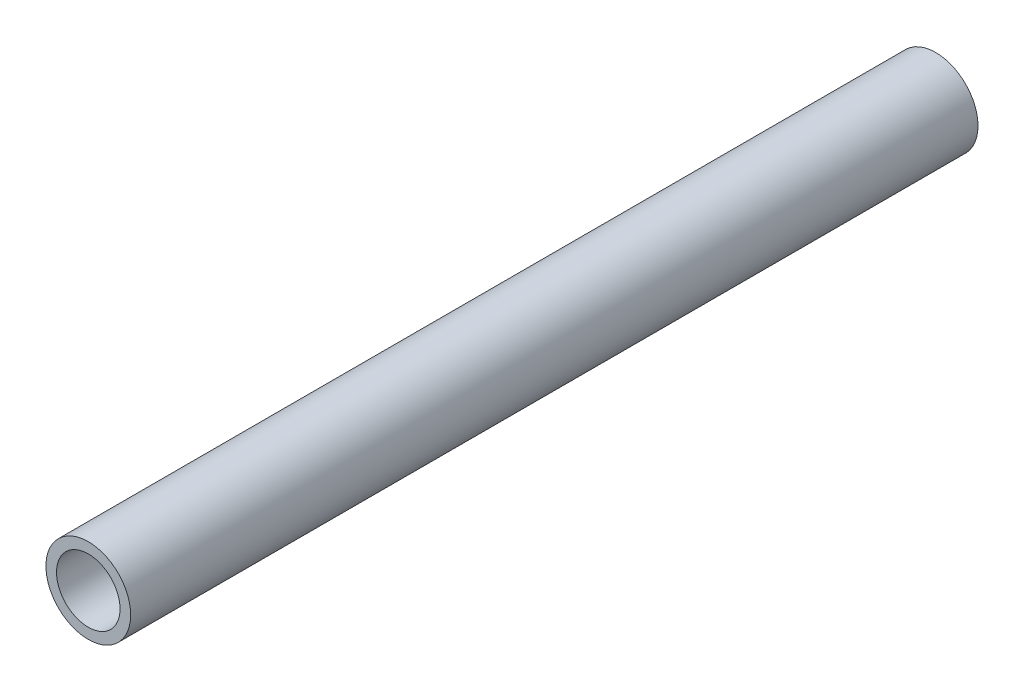
ISO-10303-21;
HEADER;
FILE_DESCRIPTION(('STEP AP214'),'2;1');
FILE_NAME('part.step','',(''),(''),'','','');
FILE_SCHEMA(('AUTOMOTIVE_DESIGN { 1 0 10303 214 1 1 1 1 }'));
ENDSEC;
DATA;
#1=APPLICATION_CONTEXT('core data for automotive mechanical design processes');
#2=APPLICATION_PROTOCOL_DEFINITION('international standard','automotive_design',2000,#1);
#3=PRODUCT_CONTEXT('',#1,'mechanical');
#4=PRODUCT('Part','Part','',(#3));
#5=PRODUCT_RELATED_PRODUCT_CATEGORY('part','',(#4));
#6=PRODUCT_DEFINITION_FORMATION('','',#4);
#7=PRODUCT_DEFINITION_CONTEXT('part definition',#1,'design');
#8=PRODUCT_DEFINITION('design','',#6,#7);
#9=PRODUCT_DEFINITION_SHAPE('','',#8);
#10=(LENGTH_UNIT() NAMED_UNIT(*) SI_UNIT(.MILLI.,.METRE.));
#11=(NAMED_UNIT(*) PLANE_ANGLE_UNIT() SI_UNIT($,.RADIAN.));
#12=(NAMED_UNIT(*) SI_UNIT($,.STERADIAN.) SOLID_ANGLE_UNIT());
#13=UNCERTAINTY_MEASURE_WITH_UNIT(LENGTH_MEASURE(1.E-05),#10,'distance_accuracy_value','');
#14=(GEOMETRIC_REPRESENTATION_CONTEXT(3) GLOBAL_UNCERTAINTY_ASSIGNED_CONTEXT((#13)) GLOBAL_UNIT_ASSIGNED_CONTEXT((#10,
#11,#12)) REPRESENTATION_CONTEXT('',''));
#15=CARTESIAN_POINT('',(0.,0.,0.));
#16=DIRECTION('',(0.,0.,1.));
#17=DIRECTION('',(1.,0.,0.));
#18=AXIS2_PLACEMENT_3D('',#15,#16,#17);
#19=CARTESIAN_POINT('',(0.,0.,80.));
#20=DIRECTION('',(0.,0.,1.));
#21=DIRECTION('',(1.,0.,0.));
#22=AXIS2_PLACEMENT_3D('',#19,#20,#21);
#23=PLANE('',#22);
#24=CARTESIAN_POINT('',(0.,0.,80.));
#25=DIRECTION('',(0.,0.,1.));
#26=DIRECTION('',(1.,0.,0.));
#27=AXIS2_PLACEMENT_3D('',#24,#25,#26);
#28=CIRCLE('',#27,4.);
#29=CARTESIAN_POINT('',(4.,0.,80.));
#30=VERTEX_POINT('',#29);
#31=EDGE_CURVE('E10',#30,#30,#28,.T.);
#32=ORIENTED_EDGE('',*,*,#31,.T.);
#33=EDGE_LOOP('',(#32));
#34=FACE_BOUND('',#33,.T.);
#35=CARTESIAN_POINT('',(0.,0.,80.));
#36=DIRECTION('',(0.,0.,1.));
#37=DIRECTION('',(1.,0.,0.));
#38=AXIS2_PLACEMENT_3D('',#35,#36,#37);
#39=CIRCLE('',#38,3.);
#40=CARTESIAN_POINT('',(3.,0.,80.));
#41=VERTEX_POINT('',#40);
#42=EDGE_CURVE('E41',#41,#41,#39,.T.);
#43=ORIENTED_EDGE('',*,*,#42,.F.);
#44=EDGE_LOOP('',(#43));
#45=FACE_BOUND('',#44,.T.);
#46=ADVANCED_FACE('F30',(#34,#45),#23,.T.);
#47=CARTESIAN_POINT('',(0.,0.,0.));
#48=DIRECTION('',(0.,0.,1.));
#49=DIRECTION('',(1.,0.,0.));
#50=AXIS2_PLACEMENT_3D('',#47,#48,#49);
#51=PLANE('',#50);
#52=CARTESIAN_POINT('',(0.,0.,0.));
#53=DIRECTION('',(0.,0.,1.));
#54=DIRECTION('',(1.,0.,0.));
#55=AXIS2_PLACEMENT_3D('',#52,#53,#54);
#56=CIRCLE('',#55,4.);
#57=CARTESIAN_POINT('',(4.,0.,0.));
#58=VERTEX_POINT('',#57);
#59=EDGE_CURVE('E34',#58,#58,#56,.T.);
#60=ORIENTED_EDGE('',*,*,#59,.F.);
#61=EDGE_LOOP('',(#60));
#62=FACE_BOUND('',#61,.T.);
#63=CARTESIAN_POINT('',(0.,0.,0.));
#64=DIRECTION('',(0.,0.,1.));
#65=DIRECTION('',(1.,0.,0.));
#66=AXIS2_PLACEMENT_3D('',#63,#64,#65);
#67=CIRCLE('',#66,3.);
#68=CARTESIAN_POINT('',(3.,0.,0.));
#69=VERTEX_POINT('',#68);
#70=EDGE_CURVE('E43',#69,#69,#67,.T.);
#71=ORIENTED_EDGE('',*,*,#70,.T.);
#72=EDGE_LOOP('',(#71));
#73=FACE_BOUND('',#72,.T.);
#74=ADVANCED_FACE('F53',(#62,#73),#51,.F.);
#75=CARTESIAN_POINT('',(0.,0.,80.));
#76=DIRECTION('',(0.,0.,-1.));
#77=DIRECTION('',(-1.,0.,0.));
#78=AXIS2_PLACEMENT_3D('',#75,#76,#77);
#79=CYLINDRICAL_SURFACE('',#78,4.);
#80=ORIENTED_EDGE('',*,*,#31,.F.);
#81=EDGE_LOOP('',(#80));
#82=FACE_BOUND('',#81,.T.);
#83=ORIENTED_EDGE('',*,*,#59,.T.);
#84=EDGE_LOOP('',(#83));
#85=FACE_BOUND('',#84,.T.);
#86=ADVANCED_FACE('F32',(#82,#85),#79,.T.);
#87=CARTESIAN_POINT('',(0.,0.,80.));
#88=DIRECTION('',(0.,0.,-1.));
#89=DIRECTION('',(-1.,0.,0.));
#90=AXIS2_PLACEMENT_3D('',#87,#88,#89);
#91=CYLINDRICAL_SURFACE('',#90,3.);
#92=ORIENTED_EDGE('',*,*,#42,.T.);
#93=EDGE_LOOP('',(#92));
#94=FACE_BOUND('',#93,.T.);
#95=ORIENTED_EDGE('',*,*,#70,.F.);
#96=EDGE_LOOP('',(#95));
#97=FACE_BOUND('',#96,.T.);
#98=ADVANCED_FACE('F49',(#94,#97),#91,.F.);
#99=CLOSED_SHELL('',(#46,#74,#86,#98));
#100=MANIFOLD_SOLID_BREP('B2',#99);
#101=ADVANCED_BREP_SHAPE_REPRESENTATION('',(#18,#100),#14);
#102=SHAPE_DEFINITION_REPRESENTATION(#9,#101);
ENDSEC;
END-ISO-10303-21;
